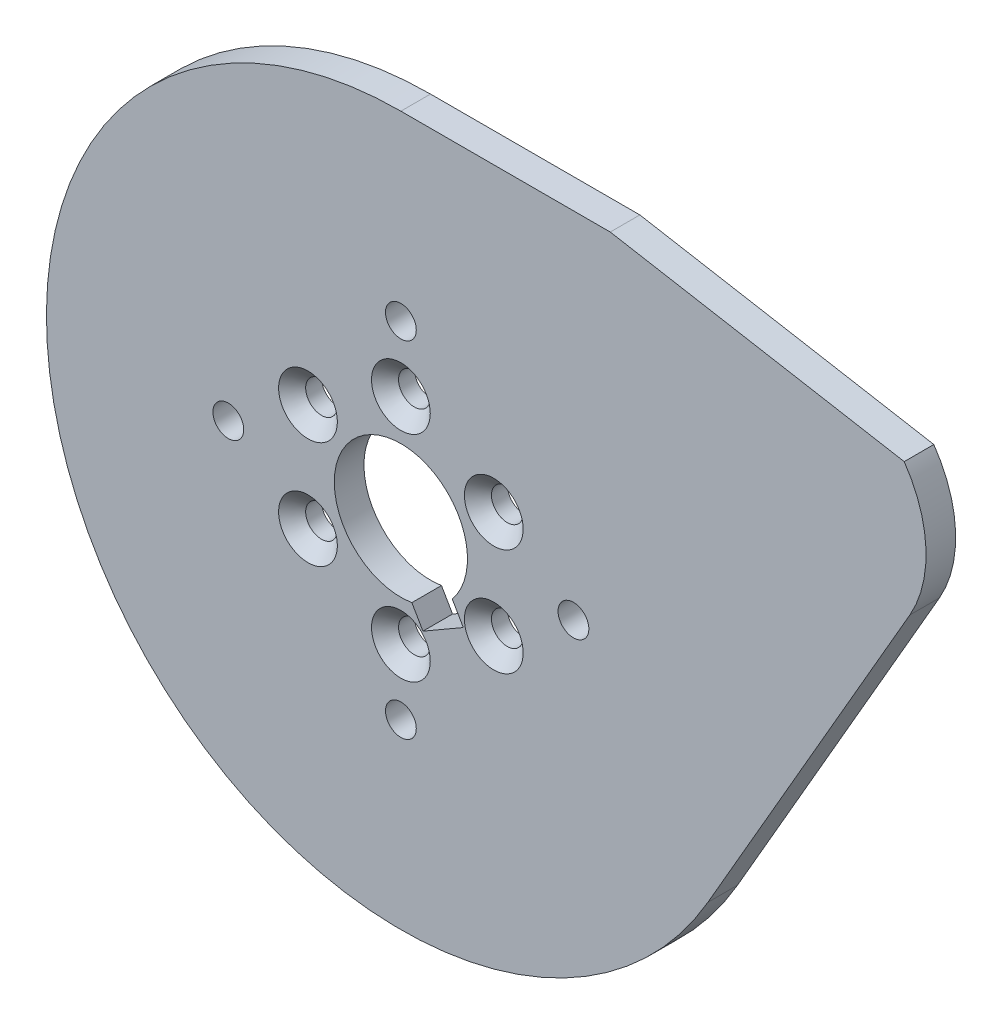
ISO-10303-21;
HEADER;
FILE_DESCRIPTION(('STEP AP214'),'2;1');
FILE_NAME('part.step','',(''),(''),'','','');
FILE_SCHEMA(('AUTOMOTIVE_DESIGN { 1 0 10303 214 1 1 1 1 }'));
ENDSEC;
DATA;
#1=APPLICATION_CONTEXT('core data for automotive mechanical design processes');
#2=APPLICATION_PROTOCOL_DEFINITION('international standard','automotive_design',2000,#1);
#3=PRODUCT_CONTEXT('',#1,'mechanical');
#4=PRODUCT('Part','Part','',(#3));
#5=PRODUCT_RELATED_PRODUCT_CATEGORY('part','',(#4));
#6=PRODUCT_DEFINITION_FORMATION('','',#4);
#7=PRODUCT_DEFINITION_CONTEXT('part definition',#1,'design');
#8=PRODUCT_DEFINITION('design','',#6,#7);
#9=PRODUCT_DEFINITION_SHAPE('','',#8);
#10=(LENGTH_UNIT() NAMED_UNIT(*) SI_UNIT(.MILLI.,.METRE.));
#11=(NAMED_UNIT(*) PLANE_ANGLE_UNIT() SI_UNIT($,.RADIAN.));
#12=(NAMED_UNIT(*) SI_UNIT($,.STERADIAN.) SOLID_ANGLE_UNIT());
#13=UNCERTAINTY_MEASURE_WITH_UNIT(LENGTH_MEASURE(1.E-05),#10,'distance_accuracy_value','');
#14=(GEOMETRIC_REPRESENTATION_CONTEXT(3) GLOBAL_UNCERTAINTY_ASSIGNED_CONTEXT((#13)) GLOBAL_UNIT_ASSIGNED_CONTEXT((#10,
#11,#12)) REPRESENTATION_CONTEXT('',''));
#15=CARTESIAN_POINT('',(0.,0.,0.));
#16=DIRECTION('',(0.,0.,1.));
#17=DIRECTION('',(1.,0.,0.));
#18=AXIS2_PLACEMENT_3D('',#15,#16,#17);
#19=CARTESIAN_POINT('',(43.3012701892193,24.9999999999999,0.));
#20=DIRECTION('',(0.,0.,1.));
#21=DIRECTION('',(1.,0.,0.));
#22=AXIS2_PLACEMENT_3D('',#19,#20,#21);
#23=CYLINDRICAL_SURFACE('',#22,13.0000000000015);
#24=CARTESIAN_POINT('',(43.3012701892193,24.9999999999999,3.175));
#25=DIRECTION('',(0.,0.,1.));
#26=DIRECTION('',(1.,0.,0.));
#27=AXIS2_PLACEMENT_3D('',#24,#25,#26);
#28=CIRCLE('',#27,13.0000000000015);
#29=CARTESIAN_POINT('',(54.5596004384185,18.4999999999991,3.175));
#30=VERTEX_POINT('',#29);
#31=CARTESIAN_POINT('',(53.9595020154315,32.4432583146595,3.175));
#32=VERTEX_POINT('',#31);
#33=EDGE_CURVE('E126',#30,#32,#28,.T.);
#34=ORIENTED_EDGE('',*,*,#33,.F.);
#35=DIRECTION('',(0.,0.,1.));
#36=VECTOR('',#35,1.);
#37=CARTESIAN_POINT('',(54.5596004384185,18.4999999999991,0.));
#38=LINE('',#37,#36);
#39=CARTESIAN_POINT('',(54.5596004384185,18.4999999999991,0.));
#40=VERTEX_POINT('',#39);
#41=EDGE_CURVE('E58',#40,#30,#38,.T.);
#42=ORIENTED_EDGE('',*,*,#41,.F.);
#43=CARTESIAN_POINT('',(43.3012701892193,24.9999999999999,0.));
#44=DIRECTION('',(0.,0.,1.));
#45=DIRECTION('',(1.,0.,0.));
#46=AXIS2_PLACEMENT_3D('',#43,#44,#45);
#47=CIRCLE('',#46,13.0000000000015);
#48=CARTESIAN_POINT('',(53.9595020154315,32.4432583146595,0.));
#49=VERTEX_POINT('',#48);
#50=EDGE_CURVE('E121',#40,#49,#47,.T.);
#51=ORIENTED_EDGE('',*,*,#50,.T.);
#52=DIRECTION('',(0.,0.,1.));
#53=VECTOR('',#52,1.);
#54=CARTESIAN_POINT('',(53.9595020154315,32.4432583146595,0.));
#55=LINE('',#54,#53);
#56=EDGE_CURVE('E88',#49,#32,#55,.T.);
#57=ORIENTED_EDGE('',*,*,#56,.T.);
#58=EDGE_LOOP('',(#34,#42,#51,#57));
#59=FACE_BOUND('',#58,.T.);
#60=ADVANCED_FACE('F35',(#59),#23,.T.);
#61=CARTESIAN_POINT('',(32.9089653438088,-18.9999999999998,0.));
#62=DIRECTION('',(0.866025403784445,-0.499999999999989,0.));
#63=DIRECTION('',(0.499999999999989,0.866025403784445,0.));
#64=AXIS2_PLACEMENT_3D('',#61,#62,#63);
#65=PLANE('',#64);
#66=DIRECTION('',(0.499999999999989,0.866025403784445,0.));
#67=VECTOR('',#66,1.);
#68=CARTESIAN_POINT('',(32.9089653438088,-18.9999999999998,3.175));
#69=LINE('',#68,#67);
#70=CARTESIAN_POINT('',(32.9089653438088,-18.9999999999998,3.175));
#71=VERTEX_POINT('',#70);
#72=EDGE_CURVE('E136',#71,#30,#69,.T.);
#73=ORIENTED_EDGE('',*,*,#72,.F.);
#74=DIRECTION('',(0.,0.,1.));
#75=VECTOR('',#74,1.);
#76=CARTESIAN_POINT('',(32.9089653438088,-18.9999999999998,0.));
#77=LINE('',#76,#75);
#78=CARTESIAN_POINT('',(32.9089653438088,-18.9999999999998,0.));
#79=VERTEX_POINT('',#78);
#80=EDGE_CURVE('E109',#79,#71,#77,.T.);
#81=ORIENTED_EDGE('',*,*,#80,.F.);
#82=DIRECTION('',(0.499999999999989,0.866025403784445,0.));
#83=VECTOR('',#82,1.);
#84=CARTESIAN_POINT('',(32.9089653438088,-18.9999999999998,0.));
#85=LINE('',#84,#83);
#86=EDGE_CURVE('E116',#79,#40,#85,.T.);
#87=ORIENTED_EDGE('',*,*,#86,.T.);
#88=ORIENTED_EDGE('',*,*,#41,.T.);
#89=EDGE_LOOP('',(#73,#81,#87,#88));
#90=FACE_BOUND('',#89,.T.);
#91=ADVANCED_FACE('F164',(#90),#65,.T.);
#92=CARTESIAN_POINT('',(0.,1.23512311489549E-12,0.));
#93=DIRECTION('',(0.,0.,1.));
#94=DIRECTION('',(1.,0.,0.));
#95=AXIS2_PLACEMENT_3D('',#92,#93,#94);
#96=CYLINDRICAL_SURFACE('',#95,38.0000000000004);
#97=CARTESIAN_POINT('',(0.,1.23512311489549E-12,3.175));
#98=DIRECTION('',(0.,0.,1.));
#99=DIRECTION('',(1.,0.,0.));
#100=AXIS2_PLACEMENT_3D('',#97,#98,#99);
#101=CIRCLE('',#100,38.0000000000004);
#102=CARTESIAN_POINT('',(0.,38.0000000000016,3.175));
#103=VERTEX_POINT('',#102);
#104=EDGE_CURVE('E104',#103,#71,#101,.T.);
#105=ORIENTED_EDGE('',*,*,#104,.F.);
#106=DIRECTION('',(0.,0.,1.));
#107=VECTOR('',#106,1.);
#108=CARTESIAN_POINT('',(0.,38.0000000000016,0.));
#109=LINE('',#108,#107);
#110=CARTESIAN_POINT('',(0.,38.0000000000016,0.));
#111=VERTEX_POINT('',#110);
#112=EDGE_CURVE('E98',#111,#103,#109,.T.);
#113=ORIENTED_EDGE('',*,*,#112,.F.);
#114=CARTESIAN_POINT('',(0.,1.23512311489549E-12,0.));
#115=DIRECTION('',(0.,0.,1.));
#116=DIRECTION('',(1.,0.,0.));
#117=AXIS2_PLACEMENT_3D('',#114,#115,#116);
#118=CIRCLE('',#117,38.0000000000004);
#119=EDGE_CURVE('E101',#111,#79,#118,.T.);
#120=ORIENTED_EDGE('',*,*,#119,.T.);
#121=ORIENTED_EDGE('',*,*,#80,.T.);
#122=EDGE_LOOP('',(#105,#113,#120,#121));
#123=FACE_BOUND('',#122,.T.);
#124=ADVANCED_FACE('F100',(#123),#96,.T.);
#125=CARTESIAN_POINT('',(22.4456539190408,38.0000000000013,0.));
#126=DIRECTION('',(0.,1.,0.));
#127=DIRECTION('',(-1.,0.,0.));
#128=AXIS2_PLACEMENT_3D('',#125,#126,#127);
#129=PLANE('',#128);
#130=DIRECTION('',(-1.,0.,0.));
#131=VECTOR('',#130,1.);
#132=CARTESIAN_POINT('',(22.4456539190408,38.0000000000013,3.175));
#133=LINE('',#132,#131);
#134=CARTESIAN_POINT('',(22.4456539190408,38.0000000000013,3.175));
#135=VERTEX_POINT('',#134);
#136=EDGE_CURVE('E133',#135,#103,#133,.T.);
#137=ORIENTED_EDGE('',*,*,#136,.F.);
#138=DIRECTION('',(0.,0.,1.));
#139=VECTOR('',#138,1.);
#140=CARTESIAN_POINT('',(22.4456539190408,38.0000000000013,0.));
#141=LINE('',#140,#139);
#142=CARTESIAN_POINT('',(22.4456539190408,38.0000000000013,0.));
#143=VERTEX_POINT('',#142);
#144=EDGE_CURVE('E110',#143,#135,#141,.T.);
#145=ORIENTED_EDGE('',*,*,#144,.F.);
#146=DIRECTION('',(-1.,0.,0.));
#147=VECTOR('',#146,1.);
#148=CARTESIAN_POINT('',(22.4456539190408,38.0000000000013,0.));
#149=LINE('',#148,#147);
#150=EDGE_CURVE('E115',#143,#111,#149,.T.);
#151=ORIENTED_EDGE('',*,*,#150,.T.);
#152=ORIENTED_EDGE('',*,*,#112,.T.);
#153=EDGE_LOOP('',(#137,#145,#151,#152));
#154=FACE_BOUND('',#153,.T.);
#155=ADVANCED_FACE('F118',(#154),#129,.T.);
#156=CARTESIAN_POINT('',(53.9595020154315,32.4432583146595,0.));
#157=DIRECTION('',(0.173648177666931,0.984807753012208,0.));
#158=DIRECTION('',(-0.984807753012208,0.173648177666931,0.));
#159=AXIS2_PLACEMENT_3D('',#156,#157,#158);
#160=PLANE('',#159);
#161=DIRECTION('',(-0.984807753012208,0.173648177666931,0.));
#162=VECTOR('',#161,1.);
#163=CARTESIAN_POINT('',(53.9595020154315,32.4432583146595,3.175));
#164=LINE('',#163,#162);
#165=EDGE_CURVE('E129',#32,#135,#164,.T.);
#166=ORIENTED_EDGE('',*,*,#165,.F.);
#167=ORIENTED_EDGE('',*,*,#56,.F.);
#168=DIRECTION('',(-0.984807753012208,0.173648177666931,0.));
#169=VECTOR('',#168,1.);
#170=CARTESIAN_POINT('',(53.9595020154315,32.4432583146595,0.));
#171=LINE('',#170,#169);
#172=EDGE_CURVE('E119',#49,#143,#171,.T.);
#173=ORIENTED_EDGE('',*,*,#172,.T.);
#174=ORIENTED_EDGE('',*,*,#144,.T.);
#175=EDGE_LOOP('',(#166,#167,#173,#174));
#176=FACE_BOUND('',#175,.T.);
#177=ADVANCED_FACE('F166',(#176),#160,.T.);
#178=CARTESIAN_POINT('',(43.3012701892193,24.9999999999999,0.));
#179=DIRECTION('',(0.,0.,1.));
#180=DIRECTION('',(1.,0.,0.));
#181=AXIS2_PLACEMENT_3D('',#178,#179,#180);
#182=PLANE('',#181);
#183=CARTESIAN_POINT('',(-9.95929214352075,5.74999999999949,0.));
#184=DIRECTION('',(0.,0.,1.));
#185=DIRECTION('',(1.,0.,0.));
#186=AXIS2_PLACEMENT_3D('',#183,#184,#185);
#187=CIRCLE('',#186,1.69999999999999);
#188=CARTESIAN_POINT('',(-8.25929214352076,5.74999999999949,0.));
#189=VERTEX_POINT('',#188);
#190=EDGE_CURVE('E300',#189,#189,#187,.T.);
#191=ORIENTED_EDGE('',*,*,#190,.T.);
#192=EDGE_LOOP('',(#191));
#193=FACE_BOUND('',#192,.T.);
#194=CARTESIAN_POINT('',(-9.95929214352015,-5.75000000000052,0.));
#195=DIRECTION('',(0.,0.,1.));
#196=DIRECTION('',(1.,0.,0.));
#197=AXIS2_PLACEMENT_3D('',#194,#195,#196);
#198=CIRCLE('',#197,1.69999999999999);
#199=CARTESIAN_POINT('',(-8.25929214352016,-5.75000000000052,0.));
#200=VERTEX_POINT('',#199);
#201=EDGE_CURVE('E309',#200,#200,#198,.T.);
#202=ORIENTED_EDGE('',*,*,#201,.T.);
#203=EDGE_LOOP('',(#202));
#204=FACE_BOUND('',#203,.T.);
#205=CARTESIAN_POINT('',(1.19132134712707E-12,-11.5,0.));
#206=DIRECTION('',(0.,0.,1.));
#207=DIRECTION('',(1.,0.,0.));
#208=AXIS2_PLACEMENT_3D('',#205,#206,#207);
#209=CIRCLE('',#208,1.69999999999999);
#210=CARTESIAN_POINT('',(1.70000000000118,-11.5,0.));
#211=VERTEX_POINT('',#210);
#212=EDGE_CURVE('E318',#211,#211,#209,.T.);
#213=ORIENTED_EDGE('',*,*,#212,.T.);
#214=EDGE_LOOP('',(#213));
#215=FACE_BOUND('',#214,.T.);
#216=CARTESIAN_POINT('',(9.95929214352194,-5.74999999999948,0.));
#217=DIRECTION('',(0.,0.,1.));
#218=DIRECTION('',(1.,0.,0.));
#219=AXIS2_PLACEMENT_3D('',#216,#217,#218);
#220=CIRCLE('',#219,1.69999999999999);
#221=CARTESIAN_POINT('',(11.6592921435219,-5.74999999999948,0.));
#222=VERTEX_POINT('',#221);
#223=EDGE_CURVE('E327',#222,#222,#220,.T.);
#224=ORIENTED_EDGE('',*,*,#223,.T.);
#225=EDGE_LOOP('',(#224));
#226=FACE_BOUND('',#225,.T.);
#227=CARTESIAN_POINT('',(9.95929214352134,5.75000000000052,0.));
#228=DIRECTION('',(0.,0.,1.));
#229=DIRECTION('',(1.,0.,0.));
#230=AXIS2_PLACEMENT_3D('',#227,#228,#229);
#231=CIRCLE('',#230,1.69999999999999);
#232=CARTESIAN_POINT('',(11.6592921435213,5.75000000000052,0.));
#233=VERTEX_POINT('',#232);
#234=EDGE_CURVE('E336',#233,#233,#231,.T.);
#235=ORIENTED_EDGE('',*,*,#234,.T.);
#236=EDGE_LOOP('',(#235));
#237=FACE_BOUND('',#236,.T.);
#238=CARTESIAN_POINT('',(0.,11.5,0.));
#239=DIRECTION('',(0.,0.,1.));
#240=DIRECTION('',(1.,0.,0.));
#241=AXIS2_PLACEMENT_3D('',#238,#239,#240);
#242=CIRCLE('',#241,1.69999999999999);
#243=CARTESIAN_POINT('',(1.69999999999999,11.5,0.));
#244=VERTEX_POINT('',#243);
#245=EDGE_CURVE('E345',#244,#244,#242,.T.);
#246=ORIENTED_EDGE('',*,*,#245,.T.);
#247=EDGE_LOOP('',(#246));
#248=FACE_BOUND('',#247,.T.);
#249=CARTESIAN_POINT('',(18.5000000000006,5.80012052705115E-13,0.));
#250=DIRECTION('',(0.,0.,1.));
#251=DIRECTION('',(1.,0.,0.));
#252=AXIS2_PLACEMENT_3D('',#249,#250,#251);
#253=CIRCLE('',#252,1.64999999999998);
#254=CARTESIAN_POINT('',(20.1500000000006,5.80012052705115E-13,0.));
#255=VERTEX_POINT('',#254);
#256=EDGE_CURVE('E351',#255,#255,#253,.T.);
#257=ORIENTED_EDGE('',*,*,#256,.T.);
#258=EDGE_LOOP('',(#257));
#259=FACE_BOUND('',#258,.T.);
#260=CARTESIAN_POINT('',(1.16002410541023E-12,-18.5,0.));
#261=DIRECTION('',(0.,0.,1.));
#262=DIRECTION('',(1.,0.,0.));
#263=AXIS2_PLACEMENT_3D('',#260,#261,#262);
#264=CIRCLE('',#263,1.64999999999999);
#265=CARTESIAN_POINT('',(1.65000000000115,-18.5,0.));
#266=VERTEX_POINT('',#265);
#267=EDGE_CURVE('E357',#266,#266,#264,.T.);
#268=ORIENTED_EDGE('',*,*,#267,.T.);
#269=EDGE_LOOP('',(#268));
#270=FACE_BOUND('',#269,.T.);
#271=CARTESIAN_POINT('',(-18.4999999999994,-5.82277649283538E-13,0.));
#272=DIRECTION('',(0.,0.,1.));
#273=DIRECTION('',(1.,0.,0.));
#274=AXIS2_PLACEMENT_3D('',#271,#272,#273);
#275=CIRCLE('',#274,1.64999999999998);
#276=CARTESIAN_POINT('',(-16.8499999999994,-5.82277649283538E-13,0.));
#277=VERTEX_POINT('',#276);
#278=EDGE_CURVE('E363',#277,#277,#275,.T.);
#279=ORIENTED_EDGE('',*,*,#278,.T.);
#280=EDGE_LOOP('',(#279));
#281=FACE_BOUND('',#280,.T.);
#282=CARTESIAN_POINT('',(0.,18.5,0.));
#283=DIRECTION('',(0.,0.,1.));
#284=DIRECTION('',(1.,0.,0.));
#285=AXIS2_PLACEMENT_3D('',#282,#283,#284);
#286=CIRCLE('',#285,1.64999999999999);
#287=CARTESIAN_POINT('',(1.64999999999999,18.5,0.));
#288=VERTEX_POINT('',#287);
#289=EDGE_CURVE('E161',#288,#288,#286,.T.);
#290=ORIENTED_EDGE('',*,*,#289,.T.);
#291=EDGE_LOOP('',(#290));
#292=FACE_BOUND('',#291,.T.);
#293=CARTESIAN_POINT('',(0.,0.,0.));
#294=DIRECTION('',(0.,0.,-1.));
#295=DIRECTION('',(-1.,0.,0.));
#296=AXIS2_PLACEMENT_3D('',#293,#294,#295);
#297=CIRCLE('',#296,7.1374);
#298=CARTESIAN_POINT('',(1.177558169701,-7.03959057878869,0.));
#299=VERTEX_POINT('',#298);
#300=CARTESIAN_POINT('',(5.50768518862296,-4.53959057878828,0.));
#301=VERTEX_POINT('',#300);
#302=EDGE_CURVE('E149',#299,#301,#297,.T.);
#303=ORIENTED_EDGE('',*,*,#302,.F.);
#304=DIRECTION('',(-0.500000000000065,0.866025403784401,0.));
#305=VECTOR('',#304,1.);
#306=CARTESIAN_POINT('',(1.10967724974493,-6.92201737656027,0.));
#307=LINE('',#306,#305);
#308=CARTESIAN_POINT('',(2.36418643826195,-9.09489102963338,0.));
#309=VERTEX_POINT('',#308);
#310=EDGE_CURVE('E283',#309,#299,#307,.T.);
#311=ORIENTED_EDGE('',*,*,#310,.F.);
#312=DIRECTION('',(-0.866025403784401,-0.500000000000065,0.));
#313=VECTOR('',#312,1.);
#314=CARTESIAN_POINT('',(2.36418643826195,-9.09489102963338,0.));
#315=LINE('',#314,#313);
#316=CARTESIAN_POINT('',(6.69431345718396,-6.59489102963305,0.));
#317=VERTEX_POINT('',#316);
#318=EDGE_CURVE('E270',#317,#309,#315,.T.);
#319=ORIENTED_EDGE('',*,*,#318,.F.);
#320=DIRECTION('',(0.500000000000065,-0.866025403784401,0.));
#321=VECTOR('',#320,1.);
#322=CARTESIAN_POINT('',(6.69431345718396,-6.59489102963305,0.));
#323=LINE('',#322,#321);
#324=EDGE_CURVE('E280',#301,#317,#323,.T.);
#325=ORIENTED_EDGE('',*,*,#324,.F.);
#326=EDGE_LOOP('',(#303,#311,#319,#325));
#327=FACE_BOUND('',#326,.T.);
#328=ORIENTED_EDGE('',*,*,#50,.F.);
#329=ORIENTED_EDGE('',*,*,#86,.F.);
#330=ORIENTED_EDGE('',*,*,#119,.F.);
#331=ORIENTED_EDGE('',*,*,#150,.F.);
#332=ORIENTED_EDGE('',*,*,#172,.F.);
#333=EDGE_LOOP('',(#328,#329,#330,#331,#332));
#334=FACE_BOUND('',#333,.T.);
#335=ADVANCED_FACE('F114',(#193,#204,#215,#226,#237,#248,#259,#270,#281,#292,#327,#334),#182,.F.);
#336=CARTESIAN_POINT('',(43.3012701892193,24.9999999999999,3.175));
#337=DIRECTION('',(0.,0.,1.));
#338=DIRECTION('',(1.,0.,0.));
#339=AXIS2_PLACEMENT_3D('',#336,#337,#338);
#340=PLANE('',#339);
#341=DIRECTION('',(-0.500000000000065,0.866025403784401,0.));
#342=VECTOR('',#341,1.);
#343=CARTESIAN_POINT('',(1.10967724974493,-6.92201737656027,3.175));
#344=LINE('',#343,#342);
#345=CARTESIAN_POINT('',(2.36418643826195,-9.09489102963338,3.175));
#346=VERTEX_POINT('',#345);
#347=CARTESIAN_POINT('',(1.177558169701,-7.03959057878869,3.175));
#348=VERTEX_POINT('',#347);
#349=EDGE_CURVE('E159',#346,#348,#344,.T.);
#350=ORIENTED_EDGE('',*,*,#349,.T.);
#351=CARTESIAN_POINT('',(0.,0.,3.175));
#352=DIRECTION('',(0.,0.,-1.));
#353=DIRECTION('',(-1.,0.,0.));
#354=AXIS2_PLACEMENT_3D('',#351,#352,#353);
#355=CIRCLE('',#354,7.1374);
#356=CARTESIAN_POINT('',(5.50768518862296,-4.53959057878828,3.175));
#357=VERTEX_POINT('',#356);
#358=EDGE_CURVE('E130',#348,#357,#355,.T.);
#359=ORIENTED_EDGE('',*,*,#358,.T.);
#360=DIRECTION('',(0.500000000000065,-0.866025403784401,0.));
#361=VECTOR('',#360,1.);
#362=CARTESIAN_POINT('',(6.69431345718396,-6.59489102963305,3.175));
#363=LINE('',#362,#361);
#364=CARTESIAN_POINT('',(6.69431345718396,-6.59489102963305,3.175));
#365=VERTEX_POINT('',#364);
#366=EDGE_CURVE('E49',#357,#365,#363,.T.);
#367=ORIENTED_EDGE('',*,*,#366,.T.);
#368=DIRECTION('',(-0.866025403784401,-0.500000000000065,0.));
#369=VECTOR('',#368,1.);
#370=CARTESIAN_POINT('',(2.36418643826195,-9.09489102963338,3.175));
#371=LINE('',#370,#369);
#372=EDGE_CURVE('E289',#365,#346,#371,.T.);
#373=ORIENTED_EDGE('',*,*,#372,.T.);
#374=EDGE_LOOP('',(#350,#359,#367,#373));
#375=FACE_BOUND('',#374,.T.);
#376=CARTESIAN_POINT('',(-9.95929214352075,5.74999999999949,3.175));
#377=DIRECTION('',(0.,0.,1.));
#378=DIRECTION('',(1.,0.,0.));
#379=AXIS2_PLACEMENT_3D('',#376,#377,#378);
#380=CIRCLE('',#379,3.1499999999771);
#381=CARTESIAN_POINT('',(-6.80929214354364,5.74999999999949,3.175));
#382=VERTEX_POINT('',#381);
#383=EDGE_CURVE('E293',#382,#382,#380,.T.);
#384=ORIENTED_EDGE('',*,*,#383,.F.);
#385=EDGE_LOOP('',(#384));
#386=FACE_BOUND('',#385,.T.);
#387=CARTESIAN_POINT('',(-9.95929214352015,-5.75000000000052,3.175));
#388=DIRECTION('',(0.,0.,1.));
#389=DIRECTION('',(1.,0.,0.));
#390=AXIS2_PLACEMENT_3D('',#387,#388,#389);
#391=CIRCLE('',#390,3.1499999999771);
#392=CARTESIAN_POINT('',(-6.80929214354305,-5.75000000000052,3.175));
#393=VERTEX_POINT('',#392);
#394=EDGE_CURVE('E303',#393,#393,#391,.T.);
#395=ORIENTED_EDGE('',*,*,#394,.F.);
#396=EDGE_LOOP('',(#395));
#397=FACE_BOUND('',#396,.T.);
#398=CARTESIAN_POINT('',(1.19132134712707E-12,-11.5,3.175));
#399=DIRECTION('',(0.,0.,1.));
#400=DIRECTION('',(1.,0.,0.));
#401=AXIS2_PLACEMENT_3D('',#398,#399,#400);
#402=CIRCLE('',#401,3.1499999999771);
#403=CARTESIAN_POINT('',(3.14999999997829,-11.5,3.175));
#404=VERTEX_POINT('',#403);
#405=EDGE_CURVE('E312',#404,#404,#402,.T.);
#406=ORIENTED_EDGE('',*,*,#405,.F.);
#407=EDGE_LOOP('',(#406));
#408=FACE_BOUND('',#407,.T.);
#409=CARTESIAN_POINT('',(9.95929214352194,-5.74999999999948,3.175));
#410=DIRECTION('',(0.,0.,1.));
#411=DIRECTION('',(1.,0.,0.));
#412=AXIS2_PLACEMENT_3D('',#409,#410,#411);
#413=CIRCLE('',#412,3.1499999999771);
#414=CARTESIAN_POINT('',(13.109292143499,-5.74999999999948,3.175));
#415=VERTEX_POINT('',#414);
#416=EDGE_CURVE('E321',#415,#415,#413,.T.);
#417=ORIENTED_EDGE('',*,*,#416,.F.);
#418=EDGE_LOOP('',(#417));
#419=FACE_BOUND('',#418,.T.);
#420=CARTESIAN_POINT('',(9.95929214352134,5.75000000000052,3.175));
#421=DIRECTION('',(0.,0.,1.));
#422=DIRECTION('',(1.,0.,0.));
#423=AXIS2_PLACEMENT_3D('',#420,#421,#422);
#424=CIRCLE('',#423,3.1499999999771);
#425=CARTESIAN_POINT('',(13.1092921434984,5.75000000000052,3.175));
#426=VERTEX_POINT('',#425);
#427=EDGE_CURVE('E330',#426,#426,#424,.T.);
#428=ORIENTED_EDGE('',*,*,#427,.F.);
#429=EDGE_LOOP('',(#428));
#430=FACE_BOUND('',#429,.T.);
#431=CARTESIAN_POINT('',(0.,11.5,3.175));
#432=DIRECTION('',(0.,0.,1.));
#433=DIRECTION('',(1.,0.,0.));
#434=AXIS2_PLACEMENT_3D('',#431,#432,#433);
#435=CIRCLE('',#434,3.1499999999771);
#436=CARTESIAN_POINT('',(3.1499999999771,11.5,3.175));
#437=VERTEX_POINT('',#436);
#438=EDGE_CURVE('E339',#437,#437,#435,.T.);
#439=ORIENTED_EDGE('',*,*,#438,.F.);
#440=EDGE_LOOP('',(#439));
#441=FACE_BOUND('',#440,.T.);
#442=CARTESIAN_POINT('',(18.5000000000006,5.80012052705115E-13,3.175));
#443=DIRECTION('',(0.,0.,1.));
#444=DIRECTION('',(1.,0.,0.));
#445=AXIS2_PLACEMENT_3D('',#442,#443,#444);
#446=CIRCLE('',#445,1.64999999999998);
#447=CARTESIAN_POINT('',(20.1500000000006,5.80012052705115E-13,3.175));
#448=VERTEX_POINT('',#447);
#449=EDGE_CURVE('E348',#448,#448,#446,.T.);
#450=ORIENTED_EDGE('',*,*,#449,.F.);
#451=EDGE_LOOP('',(#450));
#452=FACE_BOUND('',#451,.T.);
#453=CARTESIAN_POINT('',(1.16002410541023E-12,-18.5,3.175));
#454=DIRECTION('',(0.,0.,1.));
#455=DIRECTION('',(1.,0.,0.));
#456=AXIS2_PLACEMENT_3D('',#453,#454,#455);
#457=CIRCLE('',#456,1.64999999999999);
#458=CARTESIAN_POINT('',(1.65000000000115,-18.5,3.175));
#459=VERTEX_POINT('',#458);
#460=EDGE_CURVE('E354',#459,#459,#457,.T.);
#461=ORIENTED_EDGE('',*,*,#460,.F.);
#462=EDGE_LOOP('',(#461));
#463=FACE_BOUND('',#462,.T.);
#464=CARTESIAN_POINT('',(-18.4999999999994,-5.82277649283538E-13,3.175));
#465=DIRECTION('',(0.,0.,1.));
#466=DIRECTION('',(1.,0.,0.));
#467=AXIS2_PLACEMENT_3D('',#464,#465,#466);
#468=CIRCLE('',#467,1.64999999999998);
#469=CARTESIAN_POINT('',(-16.8499999999994,-5.82277649283538E-13,3.175));
#470=VERTEX_POINT('',#469);
#471=EDGE_CURVE('E360',#470,#470,#468,.T.);
#472=ORIENTED_EDGE('',*,*,#471,.F.);
#473=EDGE_LOOP('',(#472));
#474=FACE_BOUND('',#473,.T.);
#475=CARTESIAN_POINT('',(0.,18.5,3.175));
#476=DIRECTION('',(0.,0.,1.));
#477=DIRECTION('',(1.,0.,0.));
#478=AXIS2_PLACEMENT_3D('',#475,#476,#477);
#479=CIRCLE('',#478,1.64999999999999);
#480=CARTESIAN_POINT('',(1.64999999999999,18.5,3.175));
#481=VERTEX_POINT('',#480);
#482=EDGE_CURVE('E366',#481,#481,#479,.T.);
#483=ORIENTED_EDGE('',*,*,#482,.F.);
#484=EDGE_LOOP('',(#483));
#485=FACE_BOUND('',#484,.T.);
#486=ORIENTED_EDGE('',*,*,#33,.T.);
#487=ORIENTED_EDGE('',*,*,#165,.T.);
#488=ORIENTED_EDGE('',*,*,#136,.T.);
#489=ORIENTED_EDGE('',*,*,#104,.T.);
#490=ORIENTED_EDGE('',*,*,#72,.T.);
#491=EDGE_LOOP('',(#486,#487,#488,#489,#490));
#492=FACE_BOUND('',#491,.T.);
#493=ADVANCED_FACE('F154',(#375,#386,#397,#408,#419,#430,#441,#452,#463,#474,#485,#492),#340,.T.);
#494=CARTESIAN_POINT('',(0.,0.,3.175));
#495=DIRECTION('',(0.,0.,-1.));
#496=DIRECTION('',(-1.,0.,0.));
#497=AXIS2_PLACEMENT_3D('',#494,#495,#496);
#498=CYLINDRICAL_SURFACE('',#497,7.1374);
#499=ORIENTED_EDGE('',*,*,#358,.F.);
#500=DIRECTION('',(0.,0.,-1.));
#501=VECTOR('',#500,1.);
#502=CARTESIAN_POINT('',(1.177558169701,-7.03959057878869,3.175));
#503=LINE('',#502,#501);
#504=EDGE_CURVE('E11',#348,#299,#503,.T.);
#505=ORIENTED_EDGE('',*,*,#504,.T.);
#506=ORIENTED_EDGE('',*,*,#302,.T.);
#507=DIRECTION('',(0.,0.,-1.));
#508=VECTOR('',#507,1.);
#509=CARTESIAN_POINT('',(5.50768518862296,-4.53959057878828,3.175));
#510=LINE('',#509,#508);
#511=EDGE_CURVE('E42',#301,#357,#510,.F.);
#512=ORIENTED_EDGE('',*,*,#511,.T.);
#513=EDGE_LOOP('',(#499,#505,#506,#512));
#514=FACE_BOUND('',#513,.T.);
#515=ADVANCED_FACE('F146',(#514),#498,.F.);
#516=CARTESIAN_POINT('',(0.,18.5,3.175));
#517=DIRECTION('',(0.,0.,1.));
#518=DIRECTION('',(1.,0.,0.));
#519=AXIS2_PLACEMENT_3D('',#516,#517,#518);
#520=CYLINDRICAL_SURFACE('',#519,1.64999999999999);
#521=ORIENTED_EDGE('',*,*,#289,.F.);
#522=EDGE_LOOP('',(#521));
#523=FACE_BOUND('',#522,.T.);
#524=ORIENTED_EDGE('',*,*,#482,.T.);
#525=EDGE_LOOP('',(#524));
#526=FACE_BOUND('',#525,.T.);
#527=ADVANCED_FACE('F189',(#523,#526),#520,.F.);
#528=CARTESIAN_POINT('',(-18.4999999999994,-5.82277649283538E-13,3.175));
#529=DIRECTION('',(0.,0.,1.));
#530=DIRECTION('',(1.,0.,0.));
#531=AXIS2_PLACEMENT_3D('',#528,#529,#530);
#532=CYLINDRICAL_SURFACE('',#531,1.64999999999998);
#533=ORIENTED_EDGE('',*,*,#278,.F.);
#534=EDGE_LOOP('',(#533));
#535=FACE_BOUND('',#534,.T.);
#536=ORIENTED_EDGE('',*,*,#471,.T.);
#537=EDGE_LOOP('',(#536));
#538=FACE_BOUND('',#537,.T.);
#539=ADVANCED_FACE('F192',(#535,#538),#532,.F.);
#540=CARTESIAN_POINT('',(1.16002410541023E-12,-18.5,3.175));
#541=DIRECTION('',(0.,0.,1.));
#542=DIRECTION('',(1.,0.,0.));
#543=AXIS2_PLACEMENT_3D('',#540,#541,#542);
#544=CYLINDRICAL_SURFACE('',#543,1.64999999999999);
#545=ORIENTED_EDGE('',*,*,#267,.F.);
#546=EDGE_LOOP('',(#545));
#547=FACE_BOUND('',#546,.T.);
#548=ORIENTED_EDGE('',*,*,#460,.T.);
#549=EDGE_LOOP('',(#548));
#550=FACE_BOUND('',#549,.T.);
#551=ADVANCED_FACE('F196',(#547,#550),#544,.F.);
#552=CARTESIAN_POINT('',(18.5000000000006,5.80012052705115E-13,3.175));
#553=DIRECTION('',(0.,0.,1.));
#554=DIRECTION('',(1.,0.,0.));
#555=AXIS2_PLACEMENT_3D('',#552,#553,#554);
#556=CYLINDRICAL_SURFACE('',#555,1.64999999999998);
#557=ORIENTED_EDGE('',*,*,#256,.F.);
#558=EDGE_LOOP('',(#557));
#559=FACE_BOUND('',#558,.T.);
#560=ORIENTED_EDGE('',*,*,#449,.T.);
#561=EDGE_LOOP('',(#560));
#562=FACE_BOUND('',#561,.T.);
#563=ADVANCED_FACE('F200',(#559,#562),#556,.F.);
#564=CARTESIAN_POINT('',(0.,11.5,3.175));
#565=DIRECTION('',(0.,0.,1.));
#566=DIRECTION('',(1.,0.,0.));
#567=AXIS2_PLACEMENT_3D('',#564,#565,#566);
#568=CYLINDRICAL_SURFACE('',#567,1.69999999999999);
#569=ORIENTED_EDGE('',*,*,#245,.F.);
#570=EDGE_LOOP('',(#569));
#571=FACE_BOUND('',#570,.T.);
#572=CARTESIAN_POINT('',(0.,11.5,1.72500000002288));
#573=DIRECTION('',(0.,0.,1.));
#574=DIRECTION('',(1.,0.,0.));
#575=AXIS2_PLACEMENT_3D('',#572,#573,#574);
#576=CIRCLE('',#575,1.69999999999999);
#577=CARTESIAN_POINT('',(1.69999999999999,11.5,1.72500000002288));
#578=VERTEX_POINT('',#577);
#579=EDGE_CURVE('E342',#578,#578,#576,.T.);
#580=ORIENTED_EDGE('',*,*,#579,.T.);
#581=EDGE_LOOP('',(#580));
#582=FACE_BOUND('',#581,.T.);
#583=ADVANCED_FACE('F204',(#571,#582),#568,.F.);
#584=CARTESIAN_POINT('',(0.,11.5,3.175));
#585=DIRECTION('',(0.,0.,1.));
#586=DIRECTION('',(1.,0.,0.));
#587=AXIS2_PLACEMENT_3D('',#584,#585,#586);
#588=CONICAL_SURFACE('',#587,3.1499999999771,0.785398163397446);
#589=ORIENTED_EDGE('',*,*,#579,.F.);
#590=EDGE_LOOP('',(#589));
#591=FACE_BOUND('',#590,.T.);
#592=ORIENTED_EDGE('',*,*,#438,.T.);
#593=EDGE_LOOP('',(#592));
#594=FACE_BOUND('',#593,.T.);
#595=ADVANCED_FACE('F208',(#591,#594),#588,.F.);
#596=CARTESIAN_POINT('',(9.95929214352134,5.75000000000052,3.175));
#597=DIRECTION('',(0.,0.,1.));
#598=DIRECTION('',(1.,0.,0.));
#599=AXIS2_PLACEMENT_3D('',#596,#597,#598);
#600=CYLINDRICAL_SURFACE('',#599,1.69999999999999);
#601=ORIENTED_EDGE('',*,*,#234,.F.);
#602=EDGE_LOOP('',(#601));
#603=FACE_BOUND('',#602,.T.);
#604=CARTESIAN_POINT('',(9.95929214352134,5.75000000000052,1.72500000002288));
#605=DIRECTION('',(0.,0.,1.));
#606=DIRECTION('',(1.,0.,0.));
#607=AXIS2_PLACEMENT_3D('',#604,#605,#606);
#608=CIRCLE('',#607,1.69999999999999);
#609=CARTESIAN_POINT('',(11.6592921435213,5.75000000000052,1.72500000002288));
#610=VERTEX_POINT('',#609);
#611=EDGE_CURVE('E333',#610,#610,#608,.T.);
#612=ORIENTED_EDGE('',*,*,#611,.T.);
#613=EDGE_LOOP('',(#612));
#614=FACE_BOUND('',#613,.T.);
#615=ADVANCED_FACE('F212',(#603,#614),#600,.F.);
#616=CARTESIAN_POINT('',(9.95929214352134,5.75000000000052,3.175));
#617=DIRECTION('',(0.,0.,1.));
#618=DIRECTION('',(1.,0.,0.));
#619=AXIS2_PLACEMENT_3D('',#616,#617,#618);
#620=CONICAL_SURFACE('',#619,3.1499999999771,0.785398163397446);
#621=ORIENTED_EDGE('',*,*,#611,.F.);
#622=EDGE_LOOP('',(#621));
#623=FACE_BOUND('',#622,.T.);
#624=ORIENTED_EDGE('',*,*,#427,.T.);
#625=EDGE_LOOP('',(#624));
#626=FACE_BOUND('',#625,.T.);
#627=ADVANCED_FACE('F216',(#623,#626),#620,.F.);
#628=CARTESIAN_POINT('',(9.95929214352194,-5.74999999999948,3.175));
#629=DIRECTION('',(0.,0.,1.));
#630=DIRECTION('',(1.,0.,0.));
#631=AXIS2_PLACEMENT_3D('',#628,#629,#630);
#632=CYLINDRICAL_SURFACE('',#631,1.69999999999999);
#633=ORIENTED_EDGE('',*,*,#223,.F.);
#634=EDGE_LOOP('',(#633));
#635=FACE_BOUND('',#634,.T.);
#636=CARTESIAN_POINT('',(9.95929214352194,-5.74999999999948,1.72500000002288));
#637=DIRECTION('',(0.,0.,1.));
#638=DIRECTION('',(1.,0.,0.));
#639=AXIS2_PLACEMENT_3D('',#636,#637,#638);
#640=CIRCLE('',#639,1.69999999999999);
#641=CARTESIAN_POINT('',(11.6592921435219,-5.74999999999948,1.72500000002288));
#642=VERTEX_POINT('',#641);
#643=EDGE_CURVE('E324',#642,#642,#640,.T.);
#644=ORIENTED_EDGE('',*,*,#643,.T.);
#645=EDGE_LOOP('',(#644));
#646=FACE_BOUND('',#645,.T.);
#647=ADVANCED_FACE('F220',(#635,#646),#632,.F.);
#648=CARTESIAN_POINT('',(9.95929214352194,-5.74999999999948,3.175));
#649=DIRECTION('',(0.,0.,1.));
#650=DIRECTION('',(1.,0.,0.));
#651=AXIS2_PLACEMENT_3D('',#648,#649,#650);
#652=CONICAL_SURFACE('',#651,3.1499999999771,0.785398163397446);
#653=ORIENTED_EDGE('',*,*,#643,.F.);
#654=EDGE_LOOP('',(#653));
#655=FACE_BOUND('',#654,.T.);
#656=ORIENTED_EDGE('',*,*,#416,.T.);
#657=EDGE_LOOP('',(#656));
#658=FACE_BOUND('',#657,.T.);
#659=ADVANCED_FACE('F224',(#655,#658),#652,.F.);
#660=CARTESIAN_POINT('',(1.19132134712707E-12,-11.5,3.175));
#661=DIRECTION('',(0.,0.,1.));
#662=DIRECTION('',(1.,0.,0.));
#663=AXIS2_PLACEMENT_3D('',#660,#661,#662);
#664=CYLINDRICAL_SURFACE('',#663,1.69999999999999);
#665=ORIENTED_EDGE('',*,*,#212,.F.);
#666=EDGE_LOOP('',(#665));
#667=FACE_BOUND('',#666,.T.);
#668=CARTESIAN_POINT('',(1.19132134712707E-12,-11.5,1.72500000002288));
#669=DIRECTION('',(0.,0.,1.));
#670=DIRECTION('',(1.,0.,0.));
#671=AXIS2_PLACEMENT_3D('',#668,#669,#670);
#672=CIRCLE('',#671,1.69999999999999);
#673=CARTESIAN_POINT('',(1.70000000000118,-11.5,1.72500000002288));
#674=VERTEX_POINT('',#673);
#675=EDGE_CURVE('E315',#674,#674,#672,.T.);
#676=ORIENTED_EDGE('',*,*,#675,.T.);
#677=EDGE_LOOP('',(#676));
#678=FACE_BOUND('',#677,.T.);
#679=ADVANCED_FACE('F228',(#667,#678),#664,.F.);
#680=CARTESIAN_POINT('',(1.19132134712707E-12,-11.5,3.175));
#681=DIRECTION('',(0.,0.,1.));
#682=DIRECTION('',(1.,0.,0.));
#683=AXIS2_PLACEMENT_3D('',#680,#681,#682);
#684=CONICAL_SURFACE('',#683,3.1499999999771,0.785398163397446);
#685=ORIENTED_EDGE('',*,*,#675,.F.);
#686=EDGE_LOOP('',(#685));
#687=FACE_BOUND('',#686,.T.);
#688=ORIENTED_EDGE('',*,*,#405,.T.);
#689=EDGE_LOOP('',(#688));
#690=FACE_BOUND('',#689,.T.);
#691=ADVANCED_FACE('F232',(#687,#690),#684,.F.);
#692=CARTESIAN_POINT('',(-9.95929214352015,-5.75000000000052,3.175));
#693=DIRECTION('',(0.,0.,1.));
#694=DIRECTION('',(1.,0.,0.));
#695=AXIS2_PLACEMENT_3D('',#692,#693,#694);
#696=CYLINDRICAL_SURFACE('',#695,1.69999999999999);
#697=ORIENTED_EDGE('',*,*,#201,.F.);
#698=EDGE_LOOP('',(#697));
#699=FACE_BOUND('',#698,.T.);
#700=CARTESIAN_POINT('',(-9.95929214352015,-5.75000000000052,1.72500000002288));
#701=DIRECTION('',(0.,0.,1.));
#702=DIRECTION('',(1.,0.,0.));
#703=AXIS2_PLACEMENT_3D('',#700,#701,#702);
#704=CIRCLE('',#703,1.69999999999999);
#705=CARTESIAN_POINT('',(-8.25929214352016,-5.75000000000052,1.72500000002288));
#706=VERTEX_POINT('',#705);
#707=EDGE_CURVE('E306',#706,#706,#704,.T.);
#708=ORIENTED_EDGE('',*,*,#707,.T.);
#709=EDGE_LOOP('',(#708));
#710=FACE_BOUND('',#709,.T.);
#711=ADVANCED_FACE('F236',(#699,#710),#696,.F.);
#712=CARTESIAN_POINT('',(-9.95929214352015,-5.75000000000052,3.175));
#713=DIRECTION('',(0.,0.,1.));
#714=DIRECTION('',(1.,0.,0.));
#715=AXIS2_PLACEMENT_3D('',#712,#713,#714);
#716=CONICAL_SURFACE('',#715,3.1499999999771,0.785398163397446);
#717=ORIENTED_EDGE('',*,*,#707,.F.);
#718=EDGE_LOOP('',(#717));
#719=FACE_BOUND('',#718,.T.);
#720=ORIENTED_EDGE('',*,*,#394,.T.);
#721=EDGE_LOOP('',(#720));
#722=FACE_BOUND('',#721,.T.);
#723=ADVANCED_FACE('F240',(#719,#722),#716,.F.);
#724=CARTESIAN_POINT('',(-9.95929214352075,5.74999999999949,3.175));
#725=DIRECTION('',(0.,0.,1.));
#726=DIRECTION('',(1.,0.,0.));
#727=AXIS2_PLACEMENT_3D('',#724,#725,#726);
#728=CYLINDRICAL_SURFACE('',#727,1.69999999999999);
#729=ORIENTED_EDGE('',*,*,#190,.F.);
#730=EDGE_LOOP('',(#729));
#731=FACE_BOUND('',#730,.T.);
#732=CARTESIAN_POINT('',(-9.95929214352075,5.74999999999949,1.72500000002288));
#733=DIRECTION('',(0.,0.,1.));
#734=DIRECTION('',(1.,0.,0.));
#735=AXIS2_PLACEMENT_3D('',#732,#733,#734);
#736=CIRCLE('',#735,1.69999999999999);
#737=CARTESIAN_POINT('',(-8.25929214352076,5.74999999999949,1.72500000002288));
#738=VERTEX_POINT('',#737);
#739=EDGE_CURVE('E297',#738,#738,#736,.T.);
#740=ORIENTED_EDGE('',*,*,#739,.T.);
#741=EDGE_LOOP('',(#740));
#742=FACE_BOUND('',#741,.T.);
#743=ADVANCED_FACE('F244',(#731,#742),#728,.F.);
#744=CARTESIAN_POINT('',(-9.95929214352075,5.74999999999949,3.175));
#745=DIRECTION('',(0.,0.,1.));
#746=DIRECTION('',(1.,0.,0.));
#747=AXIS2_PLACEMENT_3D('',#744,#745,#746);
#748=CONICAL_SURFACE('',#747,3.1499999999771,0.785398163397446);
#749=ORIENTED_EDGE('',*,*,#739,.F.);
#750=EDGE_LOOP('',(#749));
#751=FACE_BOUND('',#750,.T.);
#752=ORIENTED_EDGE('',*,*,#383,.T.);
#753=EDGE_LOOP('',(#752));
#754=FACE_BOUND('',#753,.T.);
#755=ADVANCED_FACE('F248',(#751,#754),#748,.F.);
#756=CARTESIAN_POINT('',(1.10967724974493,-6.92201737656027,3.175));
#757=DIRECTION('',(-0.866025403784401,-0.500000000000065,0.));
#758=DIRECTION('',(0.500000000000065,-0.866025403784401,0.));
#759=AXIS2_PLACEMENT_3D('',#756,#757,#758);
#760=PLANE('',#759);
#761=ORIENTED_EDGE('',*,*,#349,.F.);
#762=DIRECTION('',(0.,0.,-1.));
#763=VECTOR('',#762,1.);
#764=CARTESIAN_POINT('',(2.36418643826195,-9.09489102963338,3.175));
#765=LINE('',#764,#763);
#766=EDGE_CURVE('E275',#346,#309,#765,.T.);
#767=ORIENTED_EDGE('',*,*,#766,.T.);
#768=ORIENTED_EDGE('',*,*,#310,.T.);
#769=ORIENTED_EDGE('',*,*,#504,.F.);
#770=EDGE_LOOP('',(#761,#767,#768,#769));
#771=FACE_BOUND('',#770,.T.);
#772=ADVANCED_FACE('F252',(#771),#760,.F.);
#773=CARTESIAN_POINT('',(6.69431345718396,-6.59489102963305,3.175));
#774=DIRECTION('',(0.866025403784401,0.500000000000065,0.));
#775=DIRECTION('',(-0.500000000000065,0.866025403784401,0.));
#776=AXIS2_PLACEMENT_3D('',#773,#774,#775);
#777=PLANE('',#776);
#778=ORIENTED_EDGE('',*,*,#324,.T.);
#779=DIRECTION('',(0.,0.,-1.));
#780=VECTOR('',#779,1.);
#781=CARTESIAN_POINT('',(6.69431345718396,-6.59489102963305,3.175));
#782=LINE('',#781,#780);
#783=EDGE_CURVE('E277',#365,#317,#782,.T.);
#784=ORIENTED_EDGE('',*,*,#783,.F.);
#785=ORIENTED_EDGE('',*,*,#366,.F.);
#786=ORIENTED_EDGE('',*,*,#511,.F.);
#787=EDGE_LOOP('',(#778,#784,#785,#786));
#788=FACE_BOUND('',#787,.T.);
#789=ADVANCED_FACE('F256',(#788),#777,.F.);
#790=CARTESIAN_POINT('',(2.36418643826195,-9.09489102963338,3.175));
#791=DIRECTION('',(0.500000000000065,-0.866025403784401,0.));
#792=DIRECTION('',(0.866025403784401,0.500000000000065,0.));
#793=AXIS2_PLACEMENT_3D('',#790,#791,#792);
#794=PLANE('',#793);
#795=ORIENTED_EDGE('',*,*,#318,.T.);
#796=ORIENTED_EDGE('',*,*,#766,.F.);
#797=ORIENTED_EDGE('',*,*,#372,.F.);
#798=ORIENTED_EDGE('',*,*,#783,.T.);
#799=EDGE_LOOP('',(#795,#796,#797,#798));
#800=FACE_BOUND('',#799,.T.);
#801=ADVANCED_FACE('F260',(#800),#794,.F.);
#802=CLOSED_SHELL('',(#60,#91,#124,#155,#177,#335,#493,#515,#527,#539,#551,#563,#583,#595,#615,
#627,#647,#659,#679,#691,#711,#723,#743,#755,#772,#789,#801));
#803=MANIFOLD_SOLID_BREP('B2',#802);
#804=ADVANCED_BREP_SHAPE_REPRESENTATION('',(#18,#803),#14);
#805=SHAPE_DEFINITION_REPRESENTATION(#9,#804);
ENDSEC;
END-ISO-10303-21;
